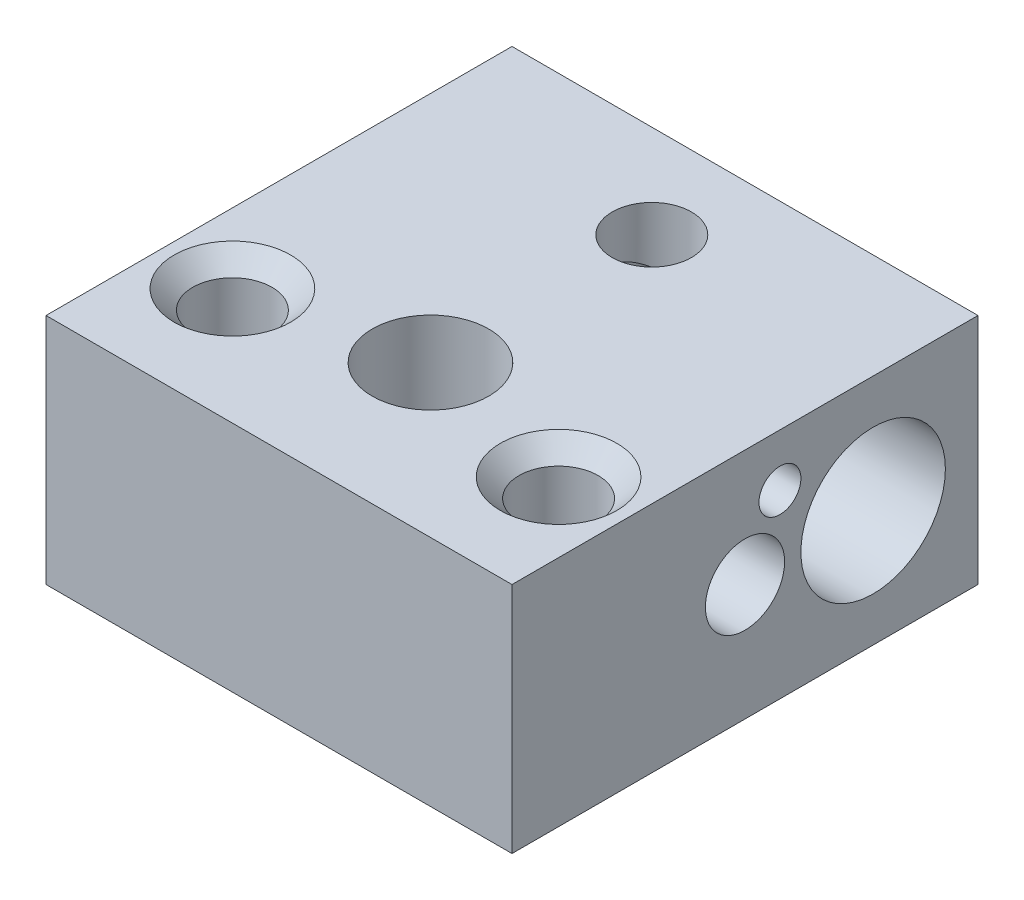
ISO-10303-21;
HEADER;
FILE_DESCRIPTION(('STEP AP214'),'2;1');
FILE_NAME('part.step','',(''),(''),'','','');
FILE_SCHEMA(('AUTOMOTIVE_DESIGN { 1 0 10303 214 1 1 1 1 }'));
ENDSEC;
DATA;
#1=APPLICATION_CONTEXT('core data for automotive mechanical design processes');
#2=APPLICATION_PROTOCOL_DEFINITION('international standard','automotive_design',2000,#1);
#3=PRODUCT_CONTEXT('',#1,'mechanical');
#4=PRODUCT('Part','Part','',(#3));
#5=PRODUCT_RELATED_PRODUCT_CATEGORY('part','',(#4));
#6=PRODUCT_DEFINITION_FORMATION('','',#4);
#7=PRODUCT_DEFINITION_CONTEXT('part definition',#1,'design');
#8=PRODUCT_DEFINITION('design','',#6,#7);
#9=PRODUCT_DEFINITION_SHAPE('','',#8);
#10=(LENGTH_UNIT() NAMED_UNIT(*) SI_UNIT(.MILLI.,.METRE.));
#11=(NAMED_UNIT(*) PLANE_ANGLE_UNIT() SI_UNIT($,.RADIAN.));
#12=(NAMED_UNIT(*) SI_UNIT($,.STERADIAN.) SOLID_ANGLE_UNIT());
#13=UNCERTAINTY_MEASURE_WITH_UNIT(LENGTH_MEASURE(1.E-05),#10,'distance_accuracy_value','');
#14=(GEOMETRIC_REPRESENTATION_CONTEXT(3) GLOBAL_UNCERTAINTY_ASSIGNED_CONTEXT((#13)) GLOBAL_UNIT_ASSIGNED_CONTEXT((#10,
#11,#12)) REPRESENTATION_CONTEXT('',''));
#15=CARTESIAN_POINT('',(0.,0.,0.));
#16=DIRECTION('',(0.,0.,1.));
#17=DIRECTION('',(1.,0.,0.));
#18=AXIS2_PLACEMENT_3D('',#15,#16,#17);
#19=CARTESIAN_POINT('',(0.,10.,-6.));
#20=DIRECTION('',(0.,1.,0.));
#21=DIRECTION('',(0.,0.,1.));
#22=AXIS2_PLACEMENT_3D('',#19,#20,#21);
#23=CYLINDRICAL_SURFACE('',#22,1.69999999999999);
#24=CARTESIAN_POINT('',(0.,2.1416788144087,-4.30000000000001));
#25=CARTESIAN_POINT('',(0.0920415591646603,2.14168088948594,-4.29999825408911));
#26=CARTESIAN_POINT('',(0.18407128991089,2.13849462780292,-4.30750253740311));
#27=CARTESIAN_POINT('',(0.365336602767709,2.12630854297195,-4.33718064161337));
#28=CARTESIAN_POINT('',(0.454571507720301,2.11730732216982,-4.35935798928416));
#29=CARTESIAN_POINT('',(0.627546098578363,2.09500060167096,-4.41744150192787));
#30=CARTESIAN_POINT('',(0.711301169334445,2.08170783454773,-4.45330711187951));
#31=CARTESIAN_POINT('',(0.871734030910604,2.05280212872083,-4.53770642105579));
#32=CARTESIAN_POINT('',(0.948409228147932,2.0371883451788,-4.58624473796869));
#33=CARTESIAN_POINT('',(1.09676722138365,2.00504689078177,-4.69764142240592));
#34=CARTESIAN_POINT('',(1.16799642543058,1.98851319915974,-4.76110353320172));
#35=CARTESIAN_POINT('',(1.29911192076185,1.95791981574356,-4.89937164154898));
#36=CARTESIAN_POINT('',(1.35899783739393,1.94386020566581,-4.974178013638));
#37=CARTESIAN_POINT('',(1.46590669203126,1.92065139224968,-5.13375577461486));
#38=CARTESIAN_POINT('',(1.51286589234923,1.91152631391905,-5.21857369542041));
#39=CARTESIAN_POINT('',(1.59177345104072,1.90050607331964,-5.39534745526949));
#40=CARTESIAN_POINT('',(1.62373408947448,1.89860498732911,-5.48729738285081));
#41=CARTESIAN_POINT('',(1.66939060524568,1.90330725252501,-5.6668896339712));
#42=CARTESIAN_POINT('',(1.68443459236892,1.9091844727107,-5.75420984219946));
#43=CARTESIAN_POINT('',(1.70079999917109,1.92860333588583,-5.92926723222066));
#44=CARTESIAN_POINT('',(1.70212392403364,1.94214357918679,-6.01700433496456));
#45=CARTESIAN_POINT('',(1.69178310226982,1.97578223389998,-6.18648502171341));
#46=CARTESIAN_POINT('',(1.68066870722754,1.99557703236014,-6.26832477247556));
#47=CARTESIAN_POINT('',(1.6472671937911,2.04098901518599,-6.42798165558693));
#48=CARTESIAN_POINT('',(1.62497766882042,2.06660745302902,-6.50579791748985));
#49=CARTESIAN_POINT('',(1.56819781416214,2.12470568096135,-6.66196528963344));
#50=CARTESIAN_POINT('',(1.53288132208591,2.1575680890948,-6.73987109126936));
#51=CARTESIAN_POINT('',(1.45192196086103,2.22703313809071,-6.8883025407596));
#52=CARTESIAN_POINT('',(1.40627170527404,2.26363844401495,-6.95882285656896));
#53=CARTESIAN_POINT('',(1.29788895664071,2.34465766623104,-7.10216868600049));
#54=CARTESIAN_POINT('',(1.23360222936046,2.38939845254216,-7.17363519547844));
#55=CARTESIAN_POINT('',(1.09373878377416,2.47841821574475,-7.3049700201501));
#56=CARTESIAN_POINT('',(1.01815638435881,2.52269694819046,-7.36483246412774));
#57=CARTESIAN_POINT('',(0.867697031525365,2.60101662139875,-7.46425639030886));
#58=CARTESIAN_POINT('',(0.794221799977539,2.63562094486924,-7.5054899395892));
#59=CARTESIAN_POINT('',(0.639748354170339,2.69847653354604,-7.57732203904077));
#60=CARTESIAN_POINT('',(0.558764767297234,2.72673979923591,-7.60794073880614));
#61=CARTESIAN_POINT('',(0.408350801297355,2.76817494196666,-7.65166651829483));
#62=CARTESIAN_POINT('',(0.340145304983591,2.7832805375551,-7.6671166748091));
#63=CARTESIAN_POINT('',(0.201095305479147,2.80540974419807,-7.68952727991166));
#64=CARTESIAN_POINT('',(0.130254339435347,2.81244381108773,-7.69649871251766));
#65=CARTESIAN_POINT('',(-0.0123038174099081,2.81742971447418,-7.70145474570478));
#66=CARTESIAN_POINT('',(-0.0840230773513625,2.8153526172632,-7.69941071637978));
#67=CARTESIAN_POINT('',(-0.225853567106004,2.80237347514231,-7.68643873209348));
#68=CARTESIAN_POINT('',(-0.295963226340146,2.79146315858704,-7.67550245016537));
#69=CARTESIAN_POINT('',(-0.446123656478002,2.75944622297575,-7.6425533953403));
#70=CARTESIAN_POINT('',(-0.525447233882101,2.73676626125758,-7.61879664083932));
#71=CARTESIAN_POINT('',(-0.677787978459462,2.68416944259968,-7.56117586543718));
#72=CARTESIAN_POINT('',(-0.750791613326088,2.6542375537901,-7.52729081595569));
#73=CARTESIAN_POINT('',(-0.911101922849304,2.58036553242158,-7.43896885338329));
#74=CARTESIAN_POINT('',(-0.995999766324322,2.53493450942224,-7.3814157155245));
#75=CARTESIAN_POINT('',(-1.15355305694113,2.44191701918215,-7.25286268164911));
#76=CARTESIAN_POINT('',(-1.22619736906727,2.39432864079606,-7.18185067840085));
#77=CARTESIAN_POINT('',(-1.35893229313701,2.30038518725969,-7.02656631682457));
#78=CARTESIAN_POINT('',(-1.4188819186662,2.25404849316827,-6.94216158212559));
#79=CARTESIAN_POINT('',(-1.52327712863201,2.16668180378069,-6.76186314060374));
#80=CARTESIAN_POINT('',(-1.56774832585531,2.12564311315352,-6.66598876980123));
#81=CARTESIAN_POINT('',(-1.63157586094991,2.059403003434,-6.4850033718099));
#82=CARTESIAN_POINT('',(-1.6541820485823,2.03267615701447,-6.40159637268826));
#83=CARTESIAN_POINT('',(-1.68654670455629,1.98599467158648,-6.23048860339941));
#84=CARTESIAN_POINT('',(-1.69631336548265,1.9660357201912,-6.14279060830469));
#85=CARTESIAN_POINT('',(-1.70197189760318,1.93376721279613,-5.96517863197915));
#86=CARTESIAN_POINT('',(-1.69781076692869,1.92148708912272,-5.87525748119067));
#87=CARTESIAN_POINT('',(-1.67511124594375,1.904932049649,-5.69649364667096));
#88=CARTESIAN_POINT('',(-1.65657371694248,1.90065665432715,-5.60765089865503));
#89=CARTESIAN_POINT('',(-1.60722349592836,1.89952133896285,-5.4396369892078));
#90=CARTESIAN_POINT('',(-1.57727663990511,1.90220232737846,-5.36021125222757));
#91=CARTESIAN_POINT('',(-1.50608664813158,1.91292113734176,-5.20700445315677));
#92=CARTESIAN_POINT('',(-1.46484201145431,1.9209596708508,-5.13322414273686));
#93=CARTESIAN_POINT('',(-1.37022567367041,1.94135191063018,-4.98996894009577));
#94=CARTESIAN_POINT('',(-1.31641291525878,1.95387455752264,-4.92081048426633));
#95=CARTESIAN_POINT('',(-1.19909641851344,1.98125995790304,-4.79178644683325));
#96=CARTESIAN_POINT('',(-1.13558769709287,1.99612391479558,-4.73192567572387));
#97=CARTESIAN_POINT('',(-0.994182889692293,2.02754719970284,-4.61776555536555));
#98=CARTESIAN_POINT('',(-0.915509533582574,2.04413972534743,-4.56443452736393));
#99=CARTESIAN_POINT('',(-0.750044281885945,2.07518994063986,-4.47145844222726));
#100=CARTESIAN_POINT('',(-0.663251714799735,2.08964745345603,-4.43181451835819));
#101=CARTESIAN_POINT('',(-0.48212572261792,2.11428295779513,-4.36691810152615));
#102=CARTESIAN_POINT('',(-0.387689475808051,2.12438432007785,-4.34192072749839));
#103=CARTESIAN_POINT('',(-0.195496184938092,2.13807895464122,-4.3084681753882));
#104=CARTESIAN_POINT('',(-0.0977414230797891,2.14167661082802,-4.30000185403005));
#105=CARTESIAN_POINT('',(0.,2.1416788144087,-4.30000000000001));
#106=B_SPLINE_CURVE_WITH_KNOTS('',3,(#24,#25,#26,#27,#28,#29,#30,#31,#32,#33,#34,#35,#36,#37,
#38,#39,#40,#41,#42,#43,#44,#45,#46,#47,#48,#49,#50,#51,#52,#53,#54,#55,#56,#57,#58,#59,#60,#61,
#62,#63,#64,#65,#66,#67,#68,#69,#70,#71,#72,#73,#74,#75,#76,#77,#78,#79,#80,#81,#82,#83,#84,#85,
#86,#87,#88,#89,#90,#91,#92,#93,#94,#95,#96,#97,#98,#99,#100,#101,#102,#103,#104,#105),
.UNSPECIFIED.,.T.,.F.,(4,2,2,2,2,2,2,2,2,2,2,2,2,2,2,2,2,2,2,2,2,2,2,2,2,2,2,2,2,2,2,2,2,2,2,2,
2,2,2,2,4),(0.,0.275756038740514,0.551578381480452,0.826589794466745,1.10170155646496,
1.39083429642346,1.67997658435079,1.97051999878726,2.26082511421481,2.52585115612198,
2.79082880534796,3.04452999729693,3.29828584755899,3.57212958628674,3.84616968648006,
4.16299387131311,4.47997794111311,4.75228977961837,5.02408183596608,5.23784536097892,
5.45133166361782,5.66549641023562,5.8798619383059,6.1360261632481,6.39272598042298,
6.72754994468088,7.06267654954227,7.40134966728095,7.73945967427666,8.00968217148485,
8.27973216257111,8.55081098887065,8.82187357573127,9.07550869145632,9.32917751934022,
9.59363183910269,9.85822253136597,10.1463486998091,10.4344987188285,10.7275291152327,
11.0203619170014),.UNSPECIFIED.);
#107=CARTESIAN_POINT('',(0.,2.1416788144087,-4.30000000000001));
#108=VERTEX_POINT('',#107);
#109=EDGE_CURVE('E45',#108,#108,#106,.T.);
#110=ORIENTED_EDGE('',*,*,#109,.T.);
#111=EDGE_LOOP('',(#110));
#112=FACE_BOUND('',#111,.T.);
#113=CARTESIAN_POINT('',(0.,0.,-6.));
#114=DIRECTION('',(0.,1.,0.));
#115=DIRECTION('',(0.,0.,1.));
#116=AXIS2_PLACEMENT_3D('',#113,#114,#115);
#117=CIRCLE('',#116,1.69999999999999);
#118=CARTESIAN_POINT('',(0.,0.,-4.30000000000001));
#119=VERTEX_POINT('',#118);
#120=EDGE_CURVE('E178',#119,#119,#117,.T.);
#121=ORIENTED_EDGE('',*,*,#120,.F.);
#122=EDGE_LOOP('',(#121));
#123=FACE_BOUND('',#122,.T.);
#124=ADVANCED_FACE('F41',(#112,#123),#23,.F.);
#125=CARTESIAN_POINT('',(10.,10.,10.));
#126=DIRECTION('',(-1.,0.,0.));
#127=DIRECTION('',(0.,0.,1.));
#128=AXIS2_PLACEMENT_3D('',#125,#126,#127);
#129=PLANE('',#128);
#130=CARTESIAN_POINT('',(10.,7.75,-1.5));
#131=DIRECTION('',(-1.,0.,0.));
#132=DIRECTION('',(0.,0.,1.));
#133=AXIS2_PLACEMENT_3D('',#130,#131,#132);
#134=CIRCLE('',#133,0.9);
#135=CARTESIAN_POINT('',(10.,7.75,-0.6));
#136=VERTEX_POINT('',#135);
#137=EDGE_CURVE('E346',#136,#136,#134,.T.);
#138=ORIENTED_EDGE('',*,*,#137,.T.);
#139=EDGE_LOOP('',(#138));
#140=FACE_BOUND('',#139,.T.);
#141=CARTESIAN_POINT('',(10.,5.,0.));
#142=DIRECTION('',(1.,0.,0.));
#143=DIRECTION('',(0.,0.,-1.));
#144=AXIS2_PLACEMENT_3D('',#141,#142,#143);
#145=CIRCLE('',#144,1.69999999999999);
#146=CARTESIAN_POINT('',(10.,5.,-1.69999999999999));
#147=VERTEX_POINT('',#146);
#148=EDGE_CURVE('E342',#147,#147,#145,.T.);
#149=ORIENTED_EDGE('',*,*,#148,.F.);
#150=EDGE_LOOP('',(#149));
#151=FACE_BOUND('',#150,.T.);
#152=CARTESIAN_POINT('',(10.,5.,-5.5));
#153=DIRECTION('',(1.,0.,0.));
#154=DIRECTION('',(0.,0.,-1.));
#155=AXIS2_PLACEMENT_3D('',#152,#153,#154);
#156=CIRCLE('',#155,3.1);
#157=CARTESIAN_POINT('',(10.,5.,-8.6));
#158=VERTEX_POINT('',#157);
#159=EDGE_CURVE('E184',#158,#158,#156,.T.);
#160=ORIENTED_EDGE('',*,*,#159,.F.);
#161=EDGE_LOOP('',(#160));
#162=FACE_BOUND('',#161,.T.);
#163=DIRECTION('',(0.,0.,-1.));
#164=VECTOR('',#163,1.);
#165=CARTESIAN_POINT('',(10.,0.,10.));
#166=LINE('',#165,#164);
#167=CARTESIAN_POINT('',(10.,0.,10.));
#168=VERTEX_POINT('',#167);
#169=CARTESIAN_POINT('',(10.,0.,-10.));
#170=VERTEX_POINT('',#169);
#171=EDGE_CURVE('E113',#168,#170,#166,.T.);
#172=ORIENTED_EDGE('',*,*,#171,.T.);
#173=DIRECTION('',(0.,-1.,0.));
#174=VECTOR('',#173,1.);
#175=CARTESIAN_POINT('',(10.,10.,-10.));
#176=LINE('',#175,#174);
#177=CARTESIAN_POINT('',(10.,10.,-10.));
#178=VERTEX_POINT('',#177);
#179=EDGE_CURVE('E11',#178,#170,#176,.T.);
#180=ORIENTED_EDGE('',*,*,#179,.F.);
#181=DIRECTION('',(0.,0.,-1.));
#182=VECTOR('',#181,1.);
#183=CARTESIAN_POINT('',(10.,10.,10.));
#184=LINE('',#183,#182);
#185=CARTESIAN_POINT('',(10.,10.,10.));
#186=VERTEX_POINT('',#185);
#187=EDGE_CURVE('E100',#186,#178,#184,.T.);
#188=ORIENTED_EDGE('',*,*,#187,.F.);
#189=DIRECTION('',(0.,-1.,0.));
#190=VECTOR('',#189,1.);
#191=CARTESIAN_POINT('',(10.,10.,10.));
#192=LINE('',#191,#190);
#193=EDGE_CURVE('E109',#186,#168,#192,.T.);
#194=ORIENTED_EDGE('',*,*,#193,.T.);
#195=EDGE_LOOP('',(#172,#180,#188,#194));
#196=FACE_BOUND('',#195,.T.);
#197=ADVANCED_FACE('F43',(#140,#151,#162,#196),#129,.F.);
#198=CARTESIAN_POINT('',(-10.,10.,-10.));
#199=DIRECTION('',(0.,0.,1.));
#200=DIRECTION('',(1.,0.,0.));
#201=AXIS2_PLACEMENT_3D('',#198,#199,#200);
#202=PLANE('',#201);
#203=DIRECTION('',(-1.,0.,0.));
#204=VECTOR('',#203,1.);
#205=CARTESIAN_POINT('',(-10.,0.,-10.));
#206=LINE('',#205,#204);
#207=CARTESIAN_POINT('',(-10.,0.,-10.));
#208=VERTEX_POINT('',#207);
#209=EDGE_CURVE('E104',#170,#208,#206,.T.);
#210=ORIENTED_EDGE('',*,*,#209,.T.);
#211=DIRECTION('',(0.,-1.,0.));
#212=VECTOR('',#211,1.);
#213=CARTESIAN_POINT('',(-10.,10.,-10.));
#214=LINE('',#213,#212);
#215=CARTESIAN_POINT('',(-10.,10.,-10.));
#216=VERTEX_POINT('',#215);
#217=EDGE_CURVE('E56',#216,#208,#214,.T.);
#218=ORIENTED_EDGE('',*,*,#217,.F.);
#219=DIRECTION('',(-1.,0.,0.));
#220=VECTOR('',#219,1.);
#221=CARTESIAN_POINT('',(-10.,10.,-10.));
#222=LINE('',#221,#220);
#223=EDGE_CURVE('E95',#178,#216,#222,.T.);
#224=ORIENTED_EDGE('',*,*,#223,.F.);
#225=ORIENTED_EDGE('',*,*,#179,.T.);
#226=EDGE_LOOP('',(#210,#218,#224,#225));
#227=FACE_BOUND('',#226,.T.);
#228=ADVANCED_FACE('F103',(#227),#202,.F.);
#229=CARTESIAN_POINT('',(-10.,10.,10.));
#230=DIRECTION('',(1.,0.,0.));
#231=DIRECTION('',(0.,0.,-1.));
#232=AXIS2_PLACEMENT_3D('',#229,#230,#231);
#233=PLANE('',#232);
#234=CARTESIAN_POINT('',(-10.,5.,-5.5));
#235=DIRECTION('',(1.,0.,0.));
#236=DIRECTION('',(0.,0.,-1.));
#237=AXIS2_PLACEMENT_3D('',#234,#235,#236);
#238=CIRCLE('',#237,3.1);
#239=CARTESIAN_POINT('',(-10.,5.,-8.6));
#240=VERTEX_POINT('',#239);
#241=EDGE_CURVE('E126',#240,#240,#238,.T.);
#242=ORIENTED_EDGE('',*,*,#241,.T.);
#243=EDGE_LOOP('',(#242));
#244=FACE_BOUND('',#243,.T.);
#245=DIRECTION('',(0.,0.,1.));
#246=VECTOR('',#245,1.);
#247=CARTESIAN_POINT('',(-10.,0.,10.));
#248=LINE('',#247,#246);
#249=CARTESIAN_POINT('',(-10.,0.,10.));
#250=VERTEX_POINT('',#249);
#251=EDGE_CURVE('E82',#208,#250,#248,.T.);
#252=ORIENTED_EDGE('',*,*,#251,.T.);
#253=DIRECTION('',(0.,-1.,0.));
#254=VECTOR('',#253,1.);
#255=CARTESIAN_POINT('',(-10.,10.,10.));
#256=LINE('',#255,#254);
#257=CARTESIAN_POINT('',(-10.,10.,10.));
#258=VERTEX_POINT('',#257);
#259=EDGE_CURVE('E105',#258,#250,#256,.T.);
#260=ORIENTED_EDGE('',*,*,#259,.F.);
#261=DIRECTION('',(0.,0.,1.));
#262=VECTOR('',#261,1.);
#263=CARTESIAN_POINT('',(-10.,10.,10.));
#264=LINE('',#263,#262);
#265=EDGE_CURVE('E98',#216,#258,#264,.T.);
#266=ORIENTED_EDGE('',*,*,#265,.F.);
#267=ORIENTED_EDGE('',*,*,#217,.T.);
#268=EDGE_LOOP('',(#252,#260,#266,#267));
#269=FACE_BOUND('',#268,.T.);
#270=ADVANCED_FACE('F107',(#244,#269),#233,.F.);
#271=CARTESIAN_POINT('',(-10.,10.,10.));
#272=DIRECTION('',(0.,0.,-1.));
#273=DIRECTION('',(-1.,0.,0.));
#274=AXIS2_PLACEMENT_3D('',#271,#272,#273);
#275=PLANE('',#274);
#276=DIRECTION('',(1.,0.,0.));
#277=VECTOR('',#276,1.);
#278=CARTESIAN_POINT('',(-10.,0.,10.));
#279=LINE('',#278,#277);
#280=EDGE_CURVE('E88',#250,#168,#279,.T.);
#281=ORIENTED_EDGE('',*,*,#280,.T.);
#282=ORIENTED_EDGE('',*,*,#193,.F.);
#283=DIRECTION('',(1.,0.,0.));
#284=VECTOR('',#283,1.);
#285=CARTESIAN_POINT('',(-10.,10.,10.));
#286=LINE('',#285,#284);
#287=EDGE_CURVE('E65',#258,#186,#286,.T.);
#288=ORIENTED_EDGE('',*,*,#287,.F.);
#289=ORIENTED_EDGE('',*,*,#259,.T.);
#290=EDGE_LOOP('',(#281,#282,#288,#289));
#291=FACE_BOUND('',#290,.T.);
#292=ADVANCED_FACE('F221',(#291),#275,.F.);
#293=CARTESIAN_POINT('',(0.,10.,0.));
#294=DIRECTION('',(0.,-1.,0.));
#295=DIRECTION('',(0.,0.,-1.));
#296=AXIS2_PLACEMENT_3D('',#293,#294,#295);
#297=PLANE('',#296);
#298=CARTESIAN_POINT('',(0.,10.,-6.));
#299=DIRECTION('',(0.,1.,0.));
#300=DIRECTION('',(0.,0.,1.));
#301=AXIS2_PLACEMENT_3D('',#298,#299,#300);
#302=CIRCLE('',#301,1.69999999999999);
#303=CARTESIAN_POINT('',(0.,10.,-4.30000000000001));
#304=VERTEX_POINT('',#303);
#305=EDGE_CURVE('E176',#304,#304,#302,.T.);
#306=ORIENTED_EDGE('',*,*,#305,.F.);
#307=EDGE_LOOP('',(#306));
#308=FACE_BOUND('',#307,.T.);
#309=CARTESIAN_POINT('',(-7.,10.,5.));
#310=DIRECTION('',(0.,1.,0.));
#311=DIRECTION('',(0.,0.,1.));
#312=AXIS2_PLACEMENT_3D('',#309,#310,#311);
#313=CIRCLE('',#312,2.5);
#314=CARTESIAN_POINT('',(-7.,10.,7.5));
#315=VERTEX_POINT('',#314);
#316=EDGE_CURVE('E181',#315,#315,#313,.T.);
#317=ORIENTED_EDGE('',*,*,#316,.F.);
#318=EDGE_LOOP('',(#317));
#319=FACE_BOUND('',#318,.T.);
#320=CARTESIAN_POINT('',(7.,10.,5.));
#321=DIRECTION('',(0.,1.,0.));
#322=DIRECTION('',(0.,0.,1.));
#323=AXIS2_PLACEMENT_3D('',#320,#321,#322);
#324=CIRCLE('',#323,2.5);
#325=CARTESIAN_POINT('',(7.,10.,7.5));
#326=VERTEX_POINT('',#325);
#327=EDGE_CURVE('E195',#326,#326,#324,.T.);
#328=ORIENTED_EDGE('',*,*,#327,.F.);
#329=EDGE_LOOP('',(#328));
#330=FACE_BOUND('',#329,.T.);
#331=CARTESIAN_POINT('',(0.,10.,3.5));
#332=DIRECTION('',(0.,1.,0.));
#333=DIRECTION('',(0.,0.,1.));
#334=AXIS2_PLACEMENT_3D('',#331,#332,#333);
#335=CIRCLE('',#334,2.5);
#336=CARTESIAN_POINT('',(0.,10.,6.));
#337=VERTEX_POINT('',#336);
#338=EDGE_CURVE('E204',#337,#337,#335,.T.);
#339=ORIENTED_EDGE('',*,*,#338,.F.);
#340=EDGE_LOOP('',(#339));
#341=FACE_BOUND('',#340,.T.);
#342=ORIENTED_EDGE('',*,*,#187,.T.);
#343=ORIENTED_EDGE('',*,*,#223,.T.);
#344=ORIENTED_EDGE('',*,*,#265,.T.);
#345=ORIENTED_EDGE('',*,*,#287,.T.);
#346=EDGE_LOOP('',(#342,#343,#344,#345));
#347=FACE_BOUND('',#346,.T.);
#348=ADVANCED_FACE('F96',(#308,#319,#330,#341,#347),#297,.F.);
#349=CARTESIAN_POINT('',(0.,0.,0.));
#350=DIRECTION('',(0.,-1.,0.));
#351=DIRECTION('',(0.,0.,-1.));
#352=AXIS2_PLACEMENT_3D('',#349,#350,#351);
#353=PLANE('',#352);
#354=ORIENTED_EDGE('',*,*,#120,.T.);
#355=EDGE_LOOP('',(#354));
#356=FACE_BOUND('',#355,.T.);
#357=CARTESIAN_POINT('',(-7.,0.,5.));
#358=DIRECTION('',(0.,1.,0.));
#359=DIRECTION('',(0.,0.,1.));
#360=AXIS2_PLACEMENT_3D('',#357,#358,#359);
#361=CIRCLE('',#360,1.7);
#362=CARTESIAN_POINT('',(-7.,0.,6.7));
#363=VERTEX_POINT('',#362);
#364=EDGE_CURVE('E192',#363,#363,#361,.T.);
#365=ORIENTED_EDGE('',*,*,#364,.T.);
#366=EDGE_LOOP('',(#365));
#367=FACE_BOUND('',#366,.T.);
#368=CARTESIAN_POINT('',(7.,0.,5.));
#369=DIRECTION('',(0.,1.,0.));
#370=DIRECTION('',(0.,0.,1.));
#371=AXIS2_PLACEMENT_3D('',#368,#369,#370);
#372=CIRCLE('',#371,1.7);
#373=CARTESIAN_POINT('',(7.,0.,6.7));
#374=VERTEX_POINT('',#373);
#375=EDGE_CURVE('E201',#374,#374,#372,.T.);
#376=ORIENTED_EDGE('',*,*,#375,.T.);
#377=EDGE_LOOP('',(#376));
#378=FACE_BOUND('',#377,.T.);
#379=CARTESIAN_POINT('',(0.,0.,3.5));
#380=DIRECTION('',(0.,1.,0.));
#381=DIRECTION('',(0.,0.,1.));
#382=AXIS2_PLACEMENT_3D('',#379,#380,#381);
#383=CIRCLE('',#382,2.5);
#384=CARTESIAN_POINT('',(0.,0.,6.));
#385=VERTEX_POINT('',#384);
#386=EDGE_CURVE('E116',#385,#385,#383,.T.);
#387=ORIENTED_EDGE('',*,*,#386,.T.);
#388=EDGE_LOOP('',(#387));
#389=FACE_BOUND('',#388,.T.);
#390=ORIENTED_EDGE('',*,*,#171,.F.);
#391=ORIENTED_EDGE('',*,*,#280,.F.);
#392=ORIENTED_EDGE('',*,*,#251,.F.);
#393=ORIENTED_EDGE('',*,*,#209,.F.);
#394=EDGE_LOOP('',(#390,#391,#392,#393));
#395=FACE_BOUND('',#394,.T.);
#396=ADVANCED_FACE('F210',(#356,#367,#378,#389,#395),#353,.T.);
#397=CARTESIAN_POINT('',(0.,10.,3.5));
#398=DIRECTION('',(0.,1.,0.));
#399=DIRECTION('',(0.,0.,1.));
#400=AXIS2_PLACEMENT_3D('',#397,#398,#399);
#401=CYLINDRICAL_SURFACE('',#400,2.5);
#402=ORIENTED_EDGE('',*,*,#386,.F.);
#403=EDGE_LOOP('',(#402));
#404=FACE_BOUND('',#403,.T.);
#405=ORIENTED_EDGE('',*,*,#338,.T.);
#406=EDGE_LOOP('',(#405));
#407=FACE_BOUND('',#406,.T.);
#408=ADVANCED_FACE('F213',(#404,#407),#401,.F.);
#409=CARTESIAN_POINT('',(7.,10.,5.));
#410=DIRECTION('',(0.,1.,0.));
#411=DIRECTION('',(0.,0.,1.));
#412=AXIS2_PLACEMENT_3D('',#409,#410,#411);
#413=CYLINDRICAL_SURFACE('',#412,1.7);
#414=ORIENTED_EDGE('',*,*,#375,.F.);
#415=EDGE_LOOP('',(#414));
#416=FACE_BOUND('',#415,.T.);
#417=CARTESIAN_POINT('',(7.,9.2,5.));
#418=DIRECTION('',(0.,1.,0.));
#419=DIRECTION('',(0.,0.,1.));
#420=AXIS2_PLACEMENT_3D('',#417,#418,#419);
#421=CIRCLE('',#420,1.7);
#422=CARTESIAN_POINT('',(7.,9.2,6.7));
#423=VERTEX_POINT('',#422);
#424=EDGE_CURVE('E198',#423,#423,#421,.T.);
#425=ORIENTED_EDGE('',*,*,#424,.T.);
#426=EDGE_LOOP('',(#425));
#427=FACE_BOUND('',#426,.T.);
#428=ADVANCED_FACE('F216',(#416,#427),#413,.F.);
#429=CARTESIAN_POINT('',(7.,10.,5.));
#430=DIRECTION('',(0.,1.,0.));
#431=DIRECTION('',(0.,0.,1.));
#432=AXIS2_PLACEMENT_3D('',#429,#430,#431);
#433=CONICAL_SURFACE('',#432,2.5,0.785398163397448);
#434=ORIENTED_EDGE('',*,*,#424,.F.);
#435=EDGE_LOOP('',(#434));
#436=FACE_BOUND('',#435,.T.);
#437=ORIENTED_EDGE('',*,*,#327,.T.);
#438=EDGE_LOOP('',(#437));
#439=FACE_BOUND('',#438,.T.);
#440=ADVANCED_FACE('F253',(#436,#439),#433,.F.);
#441=CARTESIAN_POINT('',(-7.,10.,5.));
#442=DIRECTION('',(0.,1.,0.));
#443=DIRECTION('',(0.,0.,1.));
#444=AXIS2_PLACEMENT_3D('',#441,#442,#443);
#445=CYLINDRICAL_SURFACE('',#444,1.7);
#446=ORIENTED_EDGE('',*,*,#364,.F.);
#447=EDGE_LOOP('',(#446));
#448=FACE_BOUND('',#447,.T.);
#449=CARTESIAN_POINT('',(-7.,9.2,5.));
#450=DIRECTION('',(0.,1.,0.));
#451=DIRECTION('',(0.,0.,1.));
#452=AXIS2_PLACEMENT_3D('',#449,#450,#451);
#453=CIRCLE('',#452,1.7);
#454=CARTESIAN_POINT('',(-7.,9.2,6.7));
#455=VERTEX_POINT('',#454);
#456=EDGE_CURVE('E189',#455,#455,#453,.T.);
#457=ORIENTED_EDGE('',*,*,#456,.T.);
#458=EDGE_LOOP('',(#457));
#459=FACE_BOUND('',#458,.T.);
#460=ADVANCED_FACE('F170',(#448,#459),#445,.F.);
#461=CARTESIAN_POINT('',(-7.,10.,5.));
#462=DIRECTION('',(0.,1.,0.));
#463=DIRECTION('',(0.,0.,1.));
#464=AXIS2_PLACEMENT_3D('',#461,#462,#463);
#465=CONICAL_SURFACE('',#464,2.5,0.785398163397448);
#466=ORIENTED_EDGE('',*,*,#456,.F.);
#467=EDGE_LOOP('',(#466));
#468=FACE_BOUND('',#467,.T.);
#469=ORIENTED_EDGE('',*,*,#316,.T.);
#470=EDGE_LOOP('',(#469));
#471=FACE_BOUND('',#470,.T.);
#472=ADVANCED_FACE('F165',(#468,#471),#465,.F.);
#473=CARTESIAN_POINT('',(0.,7.8583211855913,-4.30000000000001));
#474=CARTESIAN_POINT('',(-0.0920415591646603,7.85831911051406,-4.29999825408911));
#475=CARTESIAN_POINT('',(-0.184071289910891,7.86150537219708,-4.30750253740311));
#476=CARTESIAN_POINT('',(-0.365336602767709,7.87369145702805,-4.33718064161337));
#477=CARTESIAN_POINT('',(-0.454571507720301,7.88269267783018,-4.35935798928416));
#478=CARTESIAN_POINT('',(-0.627546098578363,7.90499939832904,-4.41744150192787));
#479=CARTESIAN_POINT('',(-0.711301169334445,7.91829216545227,-4.45330711187951));
#480=CARTESIAN_POINT('',(-0.871734030910604,7.94719787127917,-4.53770642105579));
#481=CARTESIAN_POINT('',(-0.948409228147932,7.9628116548212,-4.58624473796869));
#482=CARTESIAN_POINT('',(-1.09676722138365,7.99495310921823,-4.69764142240592));
#483=CARTESIAN_POINT('',(-1.16799642543058,8.01148680084026,-4.76110353320172));
#484=CARTESIAN_POINT('',(-1.29911192076185,8.04208018425644,-4.89937164154898));
#485=CARTESIAN_POINT('',(-1.35899783739393,8.05613979433419,-4.974178013638));
#486=CARTESIAN_POINT('',(-1.46590669203126,8.07934860775032,-5.13375577461486));
#487=CARTESIAN_POINT('',(-1.51286589234923,8.08847368608096,-5.21857369542041));
#488=CARTESIAN_POINT('',(-1.59177345104073,8.09949392668036,-5.39534745526949));
#489=CARTESIAN_POINT('',(-1.62373408947448,8.10139501267089,-5.48729738285081));
#490=CARTESIAN_POINT('',(-1.66939060524568,8.09669274747499,-5.66688963397121));
#491=CARTESIAN_POINT('',(-1.68443459236892,8.0908155272893,-5.75420984219946));
#492=CARTESIAN_POINT('',(-1.70079999917109,8.07139666411417,-5.92926723222066));
#493=CARTESIAN_POINT('',(-1.70212392403364,8.05785642081321,-6.01700433496456));
#494=CARTESIAN_POINT('',(-1.69178310226982,8.02421776610002,-6.18648502171342));
#495=CARTESIAN_POINT('',(-1.68066870722754,8.00442296763987,-6.26832477247556));
#496=CARTESIAN_POINT('',(-1.6472671937911,7.95901098481401,-6.42798165558693));
#497=CARTESIAN_POINT('',(-1.62497766882042,7.93339254697098,-6.50579791748985));
#498=CARTESIAN_POINT('',(-1.56819781416214,7.87529431903865,-6.66196528963344));
#499=CARTESIAN_POINT('',(-1.53288132208591,7.8424319109052,-6.73987109126936));
#500=CARTESIAN_POINT('',(-1.45192196086103,7.77296686190929,-6.8883025407596));
#501=CARTESIAN_POINT('',(-1.40627170527405,7.73636155598505,-6.95882285656896));
#502=CARTESIAN_POINT('',(-1.29788895664071,7.65534233376896,-7.10216868600049));
#503=CARTESIAN_POINT('',(-1.23360222936046,7.61060154745784,-7.17363519547844));
#504=CARTESIAN_POINT('',(-1.09373878377415,7.52158178425525,-7.3049700201501));
#505=CARTESIAN_POINT('',(-1.01815638435881,7.47730305180954,-7.36483246412774));
#506=CARTESIAN_POINT('',(-0.867697031525363,7.39898337860125,-7.46425639030886));
#507=CARTESIAN_POINT('',(-0.794221799977538,7.36437905513076,-7.5054899395892));
#508=CARTESIAN_POINT('',(-0.639748354170339,7.30152346645396,-7.57732203904077));
#509=CARTESIAN_POINT('',(-0.558764767297233,7.27326020076409,-7.60794073880614));
#510=CARTESIAN_POINT('',(-0.408350801297354,7.23182505803334,-7.65166651829483));
#511=CARTESIAN_POINT('',(-0.34014530498359,7.2167194624449,-7.6671166748091));
#512=CARTESIAN_POINT('',(-0.201095305479146,7.19459025580193,-7.68952727991166));
#513=CARTESIAN_POINT('',(-0.130254339435346,7.18755618891227,-7.69649871251766));
#514=CARTESIAN_POINT('',(0.0123038174099088,7.18257028552582,-7.70145474570478));
#515=CARTESIAN_POINT('',(0.0840230773513631,7.1846473827368,-7.69941071637978));
#516=CARTESIAN_POINT('',(0.225853567106004,7.19762652485769,-7.68643873209348));
#517=CARTESIAN_POINT('',(0.295963226340147,7.20853684141296,-7.67550245016537));
#518=CARTESIAN_POINT('',(0.446123656478002,7.24055377702425,-7.6425533953403));
#519=CARTESIAN_POINT('',(0.525447233882101,7.26323373874242,-7.61879664083932));
#520=CARTESIAN_POINT('',(0.677787978459462,7.31583055740032,-7.56117586543718));
#521=CARTESIAN_POINT('',(0.750791613326088,7.3457624462099,-7.52729081595569));
#522=CARTESIAN_POINT('',(0.911101922849305,7.41963446757842,-7.43896885338329));
#523=CARTESIAN_POINT('',(0.995999766324322,7.46506549057776,-7.3814157155245));
#524=CARTESIAN_POINT('',(1.15355305694113,7.55808298081785,-7.25286268164911));
#525=CARTESIAN_POINT('',(1.22619736906727,7.60567135920394,-7.18185067840085));
#526=CARTESIAN_POINT('',(1.35893229313701,7.69961481274031,-7.02656631682457));
#527=CARTESIAN_POINT('',(1.4188819186662,7.74595150683173,-6.94216158212559));
#528=CARTESIAN_POINT('',(1.52327712863201,7.83331819621931,-6.76186314060374));
#529=CARTESIAN_POINT('',(1.56774832585531,7.87435688684648,-6.66598876980123));
#530=CARTESIAN_POINT('',(1.63157586094991,7.940596996566,-6.4850033718099));
#531=CARTESIAN_POINT('',(1.6541820485823,7.96732384298553,-6.40159637268826));
#532=CARTESIAN_POINT('',(1.68654670455629,8.01400532841352,-6.23048860339941));
#533=CARTESIAN_POINT('',(1.69631336548265,8.0339642798088,-6.14279060830469));
#534=CARTESIAN_POINT('',(1.70197189760318,8.06623278720387,-5.96517863197915));
#535=CARTESIAN_POINT('',(1.69781076692869,8.07851291087728,-5.87525748119067));
#536=CARTESIAN_POINT('',(1.67511124594375,8.095067950351,-5.69649364667096));
#537=CARTESIAN_POINT('',(1.65657371694247,8.09934334567285,-5.60765089865503));
#538=CARTESIAN_POINT('',(1.60722349592836,8.10047866103714,-5.4396369892078));
#539=CARTESIAN_POINT('',(1.57727663990511,8.09779767262154,-5.36021125222757));
#540=CARTESIAN_POINT('',(1.50608664813158,8.08707886265824,-5.20700445315677));
#541=CARTESIAN_POINT('',(1.46484201145431,8.0790403291492,-5.13322414273686));
#542=CARTESIAN_POINT('',(1.37022567367041,8.05864808936982,-4.98996894009576));
#543=CARTESIAN_POINT('',(1.31641291525878,8.04612544247736,-4.92081048426633));
#544=CARTESIAN_POINT('',(1.19909641851344,8.01874004209696,-4.79178644683325));
#545=CARTESIAN_POINT('',(1.13558769709287,8.00387608520442,-4.73192567572387));
#546=CARTESIAN_POINT('',(0.994182889692292,7.97245280029716,-4.61776555536555));
#547=CARTESIAN_POINT('',(0.915509533582573,7.95586027465257,-4.56443452736393));
#548=CARTESIAN_POINT('',(0.750044281885944,7.92481005936014,-4.47145844222726));
#549=CARTESIAN_POINT('',(0.663251714799733,7.91035254654397,-4.43181451835819));
#550=CARTESIAN_POINT('',(0.482125722617917,7.88571704220487,-4.36691810152615));
#551=CARTESIAN_POINT('',(0.387689475808049,7.87561567992215,-4.34192072749839));
#552=CARTESIAN_POINT('',(0.19549618493809,7.86192104535878,-4.3084681753882));
#553=CARTESIAN_POINT('',(0.0977414230797883,7.85832338917198,-4.30000185403005));
#554=CARTESIAN_POINT('',(0.,7.8583211855913,-4.30000000000001));
#555=B_SPLINE_CURVE_WITH_KNOTS('',3,(#473,#474,#475,#476,#477,#478,#479,#480,#481,#482,#483,
#484,#485,#486,#487,#488,#489,#490,#491,#492,#493,#494,#495,#496,#497,#498,#499,#500,#501,#502,
#503,#504,#505,#506,#507,#508,#509,#510,#511,#512,#513,#514,#515,#516,#517,#518,#519,#520,#521,
#522,#523,#524,#525,#526,#527,#528,#529,#530,#531,#532,#533,#534,#535,#536,#537,#538,#539,#540,
#541,#542,#543,#544,#545,#546,#547,#548,#549,#550,#551,#552,#553,#554),.UNSPECIFIED.,.T.,.F.,(4,
2,2,2,2,2,2,2,2,2,2,2,2,2,2,2,2,2,2,2,2,2,2,2,2,2,2,2,2,2,2,2,2,2,2,2,2,2,2,2,4),(0.,
0.275756038740514,0.551578381480452,0.826589794466745,1.10170155646496,1.39083429642346,
1.67997658435079,1.97051999878726,2.26082511421481,2.52585115612197,2.79082880534796,
3.04452999729693,3.29828584755898,3.57212958628673,3.84616968648006,4.16299387131311,
4.47997794111311,4.75228977961837,5.02408183596608,5.23784536097892,5.45133166361782,
5.66549641023562,5.8798619383059,6.1360261632481,6.39272598042298,6.72754994468088,
7.06267654954227,7.40134966728095,7.73945967427667,8.00968217148485,8.27973216257111,
8.55081098887065,8.82187357573127,9.07550869145632,9.32917751934022,9.5936318391027,
9.85822253136597,10.1463486998091,10.4344987188286,10.7275291152327,11.0203619170014),.UNSPECIFIED.);
#556=CARTESIAN_POINT('',(0.,7.8583211855913,-4.30000000000001));
#557=VERTEX_POINT('',#556);
#558=EDGE_CURVE('E121',#557,#557,#555,.T.);
#559=ORIENTED_EDGE('',*,*,#558,.T.);
#560=EDGE_LOOP('',(#559));
#561=FACE_BOUND('',#560,.T.);
#562=ORIENTED_EDGE('',*,*,#305,.T.);
#563=EDGE_LOOP('',(#562));
#564=FACE_BOUND('',#563,.T.);
#565=ADVANCED_FACE('F127',(#561,#564),#23,.F.);
#566=CARTESIAN_POINT('',(-10.,5.,-5.5));
#567=DIRECTION('',(1.,0.,0.));
#568=DIRECTION('',(0.,0.,-1.));
#569=AXIS2_PLACEMENT_3D('',#566,#567,#568);
#570=CYLINDRICAL_SURFACE('',#569,3.1);
#571=ORIENTED_EDGE('',*,*,#558,.F.);
#572=EDGE_LOOP('',(#571));
#573=FACE_BOUND('',#572,.T.);
#574=ORIENTED_EDGE('',*,*,#241,.F.);
#575=EDGE_LOOP('',(#574));
#576=FACE_BOUND('',#575,.T.);
#577=ORIENTED_EDGE('',*,*,#159,.T.);
#578=EDGE_LOOP('',(#577));
#579=FACE_BOUND('',#578,.T.);
#580=ORIENTED_EDGE('',*,*,#109,.F.);
#581=EDGE_LOOP('',(#580));
#582=FACE_BOUND('',#581,.T.);
#583=ADVANCED_FACE('F130',(#573,#576,#579,#582),#570,.F.);
#584=CARTESIAN_POINT('',(3.,5.,0.));
#585=DIRECTION('',(-1.,0.,0.));
#586=DIRECTION('',(0.,0.,1.));
#587=AXIS2_PLACEMENT_3D('',#584,#585,#586);
#588=PLANE('',#587);
#589=CARTESIAN_POINT('',(3.,5.,0.));
#590=DIRECTION('',(1.,0.,0.));
#591=DIRECTION('',(0.,0.,-1.));
#592=AXIS2_PLACEMENT_3D('',#589,#590,#591);
#593=CIRCLE('',#592,1.7);
#594=CARTESIAN_POINT('',(3.,5.,-1.7));
#595=VERTEX_POINT('',#594);
#596=EDGE_CURVE('E338',#595,#595,#593,.T.);
#597=ORIENTED_EDGE('',*,*,#596,.T.);
#598=EDGE_LOOP('',(#597));
#599=FACE_BOUND('',#598,.T.);
#600=ADVANCED_FACE('F134',(#599),#588,.F.);
#601=CARTESIAN_POINT('',(10.,5.,0.));
#602=DIRECTION('',(1.,0.,0.));
#603=DIRECTION('',(0.,0.,-1.));
#604=AXIS2_PLACEMENT_3D('',#601,#602,#603);
#605=CYLINDRICAL_SURFACE('',#604,1.69999999999999);
#606=ORIENTED_EDGE('',*,*,#596,.F.);
#607=EDGE_LOOP('',(#606));
#608=FACE_BOUND('',#607,.T.);
#609=ORIENTED_EDGE('',*,*,#148,.T.);
#610=EDGE_LOOP('',(#609));
#611=FACE_BOUND('',#610,.T.);
#612=ADVANCED_FACE('F139',(#608,#611),#605,.F.);
#613=CARTESIAN_POINT('',(7.25,7.75,-1.5));
#614=DIRECTION('',(1.,0.,0.));
#615=DIRECTION('',(0.,0.,-1.));
#616=AXIS2_PLACEMENT_3D('',#613,#614,#615);
#617=CYLINDRICAL_SURFACE('',#616,0.9);
#618=CARTESIAN_POINT('',(7.25,7.75,-1.5));
#619=DIRECTION('',(-1.,0.,0.));
#620=DIRECTION('',(0.,0.,1.));
#621=AXIS2_PLACEMENT_3D('',#618,#619,#620);
#622=CIRCLE('',#621,0.9);
#623=CARTESIAN_POINT('',(7.25,7.75,-0.6));
#624=VERTEX_POINT('',#623);
#625=EDGE_CURVE('E345',#624,#624,#622,.T.);
#626=ORIENTED_EDGE('',*,*,#625,.T.);
#627=EDGE_LOOP('',(#626));
#628=FACE_BOUND('',#627,.T.);
#629=ORIENTED_EDGE('',*,*,#137,.F.);
#630=EDGE_LOOP('',(#629));
#631=FACE_BOUND('',#630,.T.);
#632=ADVANCED_FACE('F143',(#628,#631),#617,.F.);
#633=CARTESIAN_POINT('',(7.25,7.75,-1.5));
#634=DIRECTION('',(-1.,0.,0.));
#635=DIRECTION('',(0.,0.,1.));
#636=AXIS2_PLACEMENT_3D('',#633,#634,#635);
#637=PLANE('',#636);
#638=ORIENTED_EDGE('',*,*,#625,.F.);
#639=EDGE_LOOP('',(#638));
#640=FACE_BOUND('',#639,.T.);
#641=ADVANCED_FACE('F147',(#640),#637,.F.);
#642=CLOSED_SHELL('',(#124,#197,#228,#270,#292,#348,#396,#408,#428,#440,#460,#472,#565,#583,
#600,#612,#632,#641));
#643=MANIFOLD_SOLID_BREP('B2',#642);
#644=ADVANCED_BREP_SHAPE_REPRESENTATION('',(#18,#643),#14);
#645=SHAPE_DEFINITION_REPRESENTATION(#9,#644);
ENDSEC;
END-ISO-10303-21;
